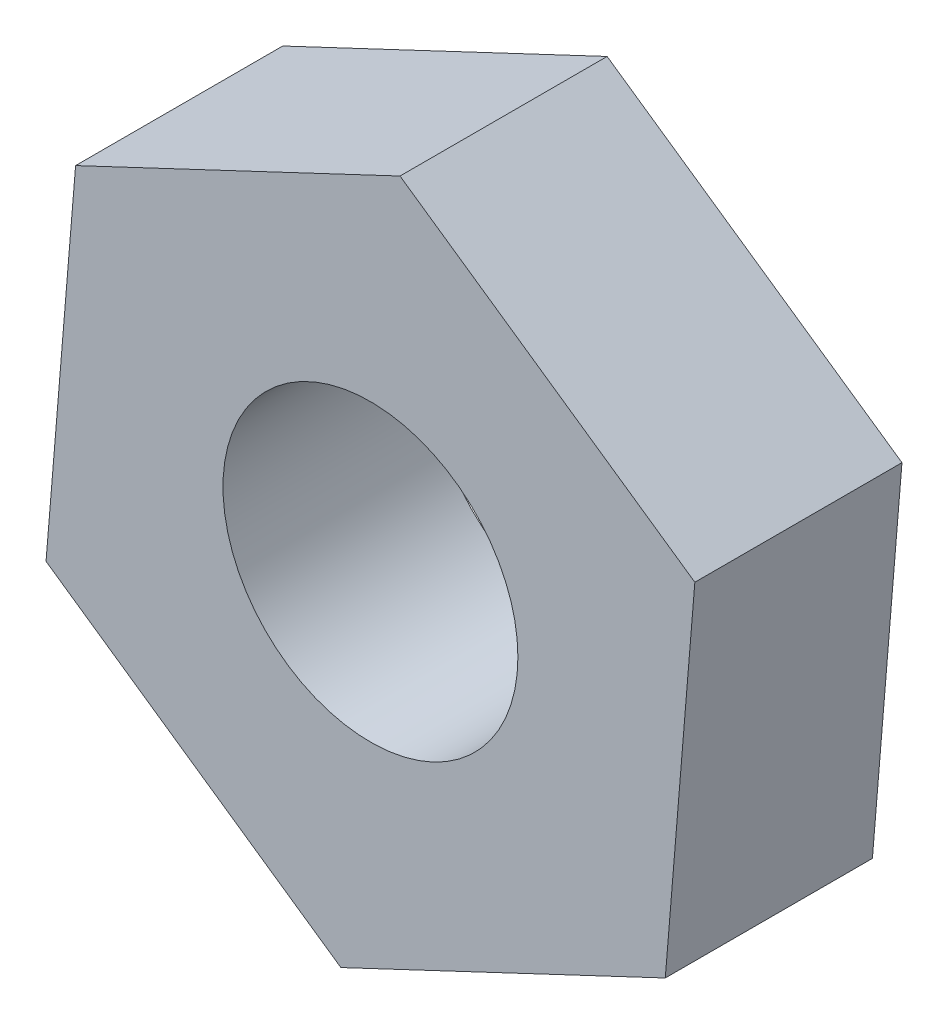
ISO-10303-21;
HEADER;
FILE_DESCRIPTION(('STEP AP214'),'2;1');
FILE_NAME('part.step','',(''),(''),'','','');
FILE_SCHEMA(('AUTOMOTIVE_DESIGN { 1 0 10303 214 1 1 1 1 }'));
ENDSEC;
DATA;
#1=APPLICATION_CONTEXT('core data for automotive mechanical design processes');
#2=APPLICATION_PROTOCOL_DEFINITION('international standard','automotive_design',2000,#1);
#3=PRODUCT_CONTEXT('',#1,'mechanical');
#4=PRODUCT('Part','Part','',(#3));
#5=PRODUCT_RELATED_PRODUCT_CATEGORY('part','',(#4));
#6=PRODUCT_DEFINITION_FORMATION('','',#4);
#7=PRODUCT_DEFINITION_CONTEXT('part definition',#1,'design');
#8=PRODUCT_DEFINITION('design','',#6,#7);
#9=PRODUCT_DEFINITION_SHAPE('','',#8);
#10=(LENGTH_UNIT() NAMED_UNIT(*) SI_UNIT(.MILLI.,.METRE.));
#11=(NAMED_UNIT(*) PLANE_ANGLE_UNIT() SI_UNIT($,.RADIAN.));
#12=(NAMED_UNIT(*) SI_UNIT($,.STERADIAN.) SOLID_ANGLE_UNIT());
#13=UNCERTAINTY_MEASURE_WITH_UNIT(LENGTH_MEASURE(1.E-05),#10,'distance_accuracy_value','');
#14=(GEOMETRIC_REPRESENTATION_CONTEXT(3) GLOBAL_UNCERTAINTY_ASSIGNED_CONTEXT((#13)) GLOBAL_UNIT_ASSIGNED_CONTEXT((#10,
#11,#12)) REPRESENTATION_CONTEXT('',''));
#15=CARTESIAN_POINT('',(0.,0.,0.));
#16=DIRECTION('',(0.,0.,1.));
#17=DIRECTION('',(1.,0.,0.));
#18=AXIS2_PLACEMENT_3D('',#15,#16,#17);
#19=CARTESIAN_POINT('',(-0.226597189069589,-2.74027780779719,1.5875));
#20=DIRECTION('',(-0.426930060131173,0.904284647528859,0.));
#21=DIRECTION('',(-0.904284647528859,-0.426930060131173,0.));
#22=AXIS2_PLACEMENT_3D('',#19,#20,#21);
#23=PLANE('',#22);
#24=DIRECTION('',(0.904284647528859,0.426930060131173,0.));
#25=VECTOR('',#24,1.);
#26=CARTESIAN_POINT('',(-0.226597189069589,-2.74027780779719,0.));
#27=LINE('',#26,#25);
#28=CARTESIAN_POINT('',(-0.226597189069589,-2.74027780779719,0.));
#29=VERTEX_POINT('',#28);
#30=CARTESIAN_POINT('',(2.2598516004443,-1.566377826059,0.));
#31=VERTEX_POINT('',#30);
#32=EDGE_CURVE('E119',#29,#31,#27,.T.);
#33=ORIENTED_EDGE('',*,*,#32,.T.);
#34=DIRECTION('',(0.,0.,-1.));
#35=VECTOR('',#34,1.);
#36=CARTESIAN_POINT('',(2.2598516004443,-1.566377826059,1.5875));
#37=LINE('',#36,#35);
#38=CARTESIAN_POINT('',(2.2598516004443,-1.566377826059,1.5875));
#39=VERTEX_POINT('',#38);
#40=EDGE_CURVE('E11',#39,#31,#37,.T.);
#41=ORIENTED_EDGE('',*,*,#40,.F.);
#42=DIRECTION('',(0.904284647528859,0.426930060131173,0.));
#43=VECTOR('',#42,1.);
#44=CARTESIAN_POINT('',(-0.226597189069589,-2.74027780779719,1.5875));
#45=LINE('',#44,#43);
#46=CARTESIAN_POINT('',(-0.226597189069589,-2.74027780779719,1.5875));
#47=VERTEX_POINT('',#46);
#48=EDGE_CURVE('E130',#47,#39,#45,.T.);
#49=ORIENTED_EDGE('',*,*,#48,.F.);
#50=DIRECTION('',(0.,0.,-1.));
#51=VECTOR('',#50,1.);
#52=CARTESIAN_POINT('',(-0.226597189069589,-2.74027780779719,1.5875));
#53=LINE('',#52,#51);
#54=EDGE_CURVE('E115',#47,#29,#53,.T.);
#55=ORIENTED_EDGE('',*,*,#54,.T.);
#56=EDGE_LOOP('',(#33,#41,#49,#55));
#57=FACE_BOUND('',#56,.T.);
#58=ADVANCED_FACE('F35',(#57),#23,.F.);
#59=CARTESIAN_POINT('',(2.2598516004443,-1.566377826059,1.5875));
#60=DIRECTION('',(-0.996598507077835,0.0824100460516158,0.));
#61=DIRECTION('',(-0.0824100460516158,-0.996598507077836,0.));
#62=AXIS2_PLACEMENT_3D('',#59,#60,#61);
#63=PLANE('',#62);
#64=DIRECTION('',(0.0824100460516158,0.996598507077836,0.));
#65=VECTOR('',#64,1.);
#66=CARTESIAN_POINT('',(2.2598516004443,-1.566377826059,0.));
#67=LINE('',#66,#65);
#68=CARTESIAN_POINT('',(2.48644878951389,1.17389998173818,0.));
#69=VERTEX_POINT('',#68);
#70=EDGE_CURVE('E122',#31,#69,#67,.T.);
#71=ORIENTED_EDGE('',*,*,#70,.T.);
#72=DIRECTION('',(0.,0.,-1.));
#73=VECTOR('',#72,1.);
#74=CARTESIAN_POINT('',(2.48644878951389,1.17389998173818,1.5875));
#75=LINE('',#74,#73);
#76=CARTESIAN_POINT('',(2.48644878951389,1.17389998173818,1.5875));
#77=VERTEX_POINT('',#76);
#78=EDGE_CURVE('E43',#77,#69,#75,.T.);
#79=ORIENTED_EDGE('',*,*,#78,.F.);
#80=DIRECTION('',(0.0824100460516158,0.996598507077836,0.));
#81=VECTOR('',#80,1.);
#82=CARTESIAN_POINT('',(2.2598516004443,-1.566377826059,1.5875));
#83=LINE('',#82,#81);
#84=EDGE_CURVE('E88',#39,#77,#83,.T.);
#85=ORIENTED_EDGE('',*,*,#84,.F.);
#86=ORIENTED_EDGE('',*,*,#40,.T.);
#87=EDGE_LOOP('',(#71,#79,#85,#86));
#88=FACE_BOUND('',#87,.T.);
#89=ADVANCED_FACE('F155',(#88),#63,.F.);
#90=CARTESIAN_POINT('',(2.48644878951389,1.17389998173818,1.5875));
#91=DIRECTION('',(-0.569668446946663,-0.821874601477243,0.));
#92=DIRECTION('',(0.821874601477243,-0.569668446946663,0.));
#93=AXIS2_PLACEMENT_3D('',#90,#91,#92);
#94=PLANE('',#93);
#95=DIRECTION('',(-0.821874601477243,0.569668446946663,0.));
#96=VECTOR('',#95,1.);
#97=CARTESIAN_POINT('',(2.48644878951389,1.17389998173818,0.));
#98=LINE('',#97,#96);
#99=CARTESIAN_POINT('',(0.22659718906959,2.74027780779719,0.));
#100=VERTEX_POINT('',#99);
#101=EDGE_CURVE('E125',#69,#100,#98,.T.);
#102=ORIENTED_EDGE('',*,*,#101,.T.);
#103=DIRECTION('',(0.,0.,-1.));
#104=VECTOR('',#103,1.);
#105=CARTESIAN_POINT('',(0.22659718906959,2.74027780779719,1.5875));
#106=LINE('',#105,#104);
#107=CARTESIAN_POINT('',(0.22659718906959,2.74027780779719,1.5875));
#108=VERTEX_POINT('',#107);
#109=EDGE_CURVE('E110',#108,#100,#106,.T.);
#110=ORIENTED_EDGE('',*,*,#109,.F.);
#111=DIRECTION('',(-0.821874601477243,0.569668446946663,0.));
#112=VECTOR('',#111,1.);
#113=CARTESIAN_POINT('',(2.48644878951389,1.17389998173818,1.5875));
#114=LINE('',#113,#112);
#115=EDGE_CURVE('E101',#77,#108,#114,.T.);
#116=ORIENTED_EDGE('',*,*,#115,.F.);
#117=ORIENTED_EDGE('',*,*,#78,.T.);
#118=EDGE_LOOP('',(#102,#110,#116,#117));
#119=FACE_BOUND('',#118,.T.);
#120=ADVANCED_FACE('F136',(#119),#94,.F.);
#121=CARTESIAN_POINT('',(0.22659718906959,2.74027780779719,1.5875));
#122=DIRECTION('',(0.426930060131173,-0.904284647528859,0.));
#123=DIRECTION('',(0.904284647528859,0.426930060131173,0.));
#124=AXIS2_PLACEMENT_3D('',#121,#122,#123);
#125=PLANE('',#124);
#126=DIRECTION('',(-0.904284647528859,-0.426930060131173,0.));
#127=VECTOR('',#126,1.);
#128=CARTESIAN_POINT('',(0.22659718906959,2.74027780779719,0.));
#129=LINE('',#128,#127);
#130=CARTESIAN_POINT('',(-2.2598516004443,1.566377826059,0.));
#131=VERTEX_POINT('',#130);
#132=EDGE_CURVE('E109',#100,#131,#129,.T.);
#133=ORIENTED_EDGE('',*,*,#132,.T.);
#134=DIRECTION('',(0.,0.,-1.));
#135=VECTOR('',#134,1.);
#136=CARTESIAN_POINT('',(-2.2598516004443,1.566377826059,1.5875));
#137=LINE('',#136,#135);
#138=CARTESIAN_POINT('',(-2.2598516004443,1.566377826059,1.5875));
#139=VERTEX_POINT('',#138);
#140=EDGE_CURVE('E106',#139,#131,#137,.T.);
#141=ORIENTED_EDGE('',*,*,#140,.F.);
#142=DIRECTION('',(-0.904284647528859,-0.426930060131173,0.));
#143=VECTOR('',#142,1.);
#144=CARTESIAN_POINT('',(0.22659718906959,2.74027780779719,1.5875));
#145=LINE('',#144,#143);
#146=EDGE_CURVE('E95',#108,#139,#145,.T.);
#147=ORIENTED_EDGE('',*,*,#146,.F.);
#148=ORIENTED_EDGE('',*,*,#109,.T.);
#149=EDGE_LOOP('',(#133,#141,#147,#148));
#150=FACE_BOUND('',#149,.T.);
#151=ADVANCED_FACE('F107',(#150),#125,.F.);
#152=CARTESIAN_POINT('',(-2.2598516004443,1.566377826059,1.5875));
#153=DIRECTION('',(0.996598507077835,-0.0824100460516158,0.));
#154=DIRECTION('',(0.0824100460516158,0.996598507077836,0.));
#155=AXIS2_PLACEMENT_3D('',#152,#153,#154);
#156=PLANE('',#155);
#157=DIRECTION('',(-0.0824100460516159,-0.996598507077836,0.));
#158=VECTOR('',#157,1.);
#159=CARTESIAN_POINT('',(-2.2598516004443,1.566377826059,0.));
#160=LINE('',#159,#158);
#161=CARTESIAN_POINT('',(-2.48644878951389,-1.17389998173818,0.));
#162=VERTEX_POINT('',#161);
#163=EDGE_CURVE('E74',#131,#162,#160,.T.);
#164=ORIENTED_EDGE('',*,*,#163,.T.);
#165=DIRECTION('',(0.,0.,-1.));
#166=VECTOR('',#165,1.);
#167=CARTESIAN_POINT('',(-2.48644878951389,-1.17389998173818,1.5875));
#168=LINE('',#167,#166);
#169=CARTESIAN_POINT('',(-2.48644878951389,-1.17389998173818,1.5875));
#170=VERTEX_POINT('',#169);
#171=EDGE_CURVE('E111',#170,#162,#168,.T.);
#172=ORIENTED_EDGE('',*,*,#171,.F.);
#173=DIRECTION('',(-0.0824100460516159,-0.996598507077836,0.));
#174=VECTOR('',#173,1.);
#175=CARTESIAN_POINT('',(-2.2598516004443,1.566377826059,1.5875));
#176=LINE('',#175,#174);
#177=EDGE_CURVE('E99',#139,#170,#176,.T.);
#178=ORIENTED_EDGE('',*,*,#177,.F.);
#179=ORIENTED_EDGE('',*,*,#140,.T.);
#180=EDGE_LOOP('',(#164,#172,#178,#179));
#181=FACE_BOUND('',#180,.T.);
#182=ADVANCED_FACE('F113',(#181),#156,.F.);
#183=CARTESIAN_POINT('',(-2.48644878951389,-1.17389998173818,1.5875));
#184=DIRECTION('',(0.569668446946663,0.821874601477243,0.));
#185=DIRECTION('',(-0.821874601477243,0.569668446946663,0.));
#186=AXIS2_PLACEMENT_3D('',#183,#184,#185);
#187=PLANE('',#186);
#188=DIRECTION('',(0.821874601477243,-0.569668446946663,0.));
#189=VECTOR('',#188,1.);
#190=CARTESIAN_POINT('',(-2.48644878951389,-1.17389998173818,0.));
#191=LINE('',#190,#189);
#192=EDGE_CURVE('E80',#162,#29,#191,.T.);
#193=ORIENTED_EDGE('',*,*,#192,.T.);
#194=ORIENTED_EDGE('',*,*,#54,.F.);
#195=DIRECTION('',(0.821874601477243,-0.569668446946663,0.));
#196=VECTOR('',#195,1.);
#197=CARTESIAN_POINT('',(-2.48644878951389,-1.17389998173818,1.5875));
#198=LINE('',#197,#196);
#199=EDGE_CURVE('E51',#170,#47,#198,.T.);
#200=ORIENTED_EDGE('',*,*,#199,.F.);
#201=ORIENTED_EDGE('',*,*,#171,.T.);
#202=EDGE_LOOP('',(#193,#194,#200,#201));
#203=FACE_BOUND('',#202,.T.);
#204=ADVANCED_FACE('F143',(#203),#187,.F.);
#205=CARTESIAN_POINT('',(0.,0.,1.5875));
#206=DIRECTION('',(0.,0.,1.));
#207=DIRECTION('',(1.,0.,0.));
#208=AXIS2_PLACEMENT_3D('',#205,#206,#207);
#209=PLANE('',#208);
#210=CARTESIAN_POINT('',(0.,0.,1.5875));
#211=DIRECTION('',(0.,0.,1.));
#212=DIRECTION('',(1.,0.,0.));
#213=AXIS2_PLACEMENT_3D('',#210,#211,#212);
#214=CIRCLE('',#213,1.1303);
#215=CARTESIAN_POINT('',(1.1303,0.,1.5875));
#216=VERTEX_POINT('',#215);
#217=EDGE_CURVE('E239',#216,#216,#214,.T.);
#218=ORIENTED_EDGE('',*,*,#217,.F.);
#219=EDGE_LOOP('',(#218));
#220=FACE_BOUND('',#219,.T.);
#221=ORIENTED_EDGE('',*,*,#48,.T.);
#222=ORIENTED_EDGE('',*,*,#84,.T.);
#223=ORIENTED_EDGE('',*,*,#115,.T.);
#224=ORIENTED_EDGE('',*,*,#146,.T.);
#225=ORIENTED_EDGE('',*,*,#177,.T.);
#226=ORIENTED_EDGE('',*,*,#199,.T.);
#227=EDGE_LOOP('',(#221,#222,#223,#224,#225,#226));
#228=FACE_BOUND('',#227,.T.);
#229=ADVANCED_FACE('F97',(#220,#228),#209,.T.);
#230=CARTESIAN_POINT('',(0.,0.,0.));
#231=DIRECTION('',(0.,0.,1.));
#232=DIRECTION('',(1.,0.,0.));
#233=AXIS2_PLACEMENT_3D('',#230,#231,#232);
#234=PLANE('',#233);
#235=CARTESIAN_POINT('',(0.,0.,0.));
#236=DIRECTION('',(0.,0.,1.));
#237=DIRECTION('',(1.,0.,0.));
#238=AXIS2_PLACEMENT_3D('',#235,#236,#237);
#239=CIRCLE('',#238,1.1303);
#240=CARTESIAN_POINT('',(1.1303,0.,0.));
#241=VERTEX_POINT('',#240);
#242=EDGE_CURVE('E123',#241,#241,#239,.T.);
#243=ORIENTED_EDGE('',*,*,#242,.T.);
#244=EDGE_LOOP('',(#243));
#245=FACE_BOUND('',#244,.T.);
#246=ORIENTED_EDGE('',*,*,#32,.F.);
#247=ORIENTED_EDGE('',*,*,#192,.F.);
#248=ORIENTED_EDGE('',*,*,#163,.F.);
#249=ORIENTED_EDGE('',*,*,#132,.F.);
#250=ORIENTED_EDGE('',*,*,#101,.F.);
#251=ORIENTED_EDGE('',*,*,#70,.F.);
#252=EDGE_LOOP('',(#246,#247,#248,#249,#250,#251));
#253=FACE_BOUND('',#252,.T.);
#254=ADVANCED_FACE('F139',(#245,#253),#234,.F.);
#255=CARTESIAN_POINT('',(0.,0.,1.5875));
#256=DIRECTION('',(0.,0.,1.));
#257=DIRECTION('',(1.,0.,0.));
#258=AXIS2_PLACEMENT_3D('',#255,#256,#257);
#259=CYLINDRICAL_SURFACE('',#258,1.1303);
#260=ORIENTED_EDGE('',*,*,#242,.F.);
#261=EDGE_LOOP('',(#260));
#262=FACE_BOUND('',#261,.T.);
#263=ORIENTED_EDGE('',*,*,#217,.T.);
#264=EDGE_LOOP('',(#263));
#265=FACE_BOUND('',#264,.T.);
#266=ADVANCED_FACE('F183',(#262,#265),#259,.F.);
#267=CLOSED_SHELL('',(#58,#89,#120,#151,#182,#204,#229,#254,#266));
#268=MANIFOLD_SOLID_BREP('B2',#267);
#269=ADVANCED_BREP_SHAPE_REPRESENTATION('',(#18,#268),#14);
#270=SHAPE_DEFINITION_REPRESENTATION(#9,#269);
ENDSEC;
END-ISO-10303-21;
